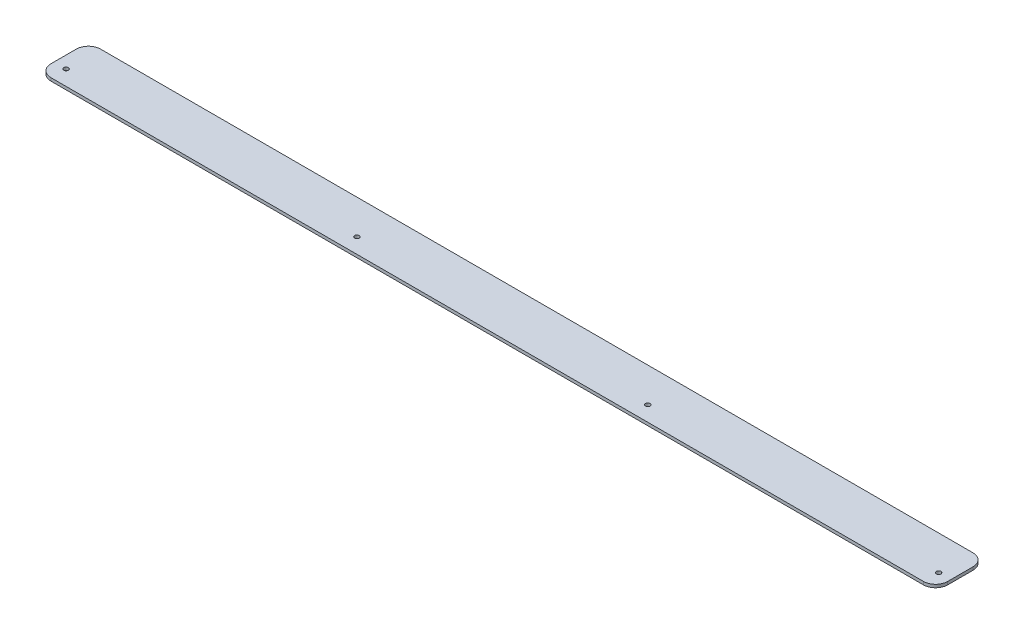
ISO-10303-21;
HEADER;
FILE_DESCRIPTION(('STEP AP214'),'2;1');
FILE_NAME('part.step','',(''),(''),'','','');
FILE_SCHEMA(('AUTOMOTIVE_DESIGN { 1 0 10303 214 1 1 1 1 }'));
ENDSEC;
DATA;
#1=APPLICATION_CONTEXT('core data for automotive mechanical design processes');
#2=APPLICATION_PROTOCOL_DEFINITION('international standard','automotive_design',2000,#1);
#3=PRODUCT_CONTEXT('',#1,'mechanical');
#4=PRODUCT('Part','Part','',(#3));
#5=PRODUCT_RELATED_PRODUCT_CATEGORY('part','',(#4));
#6=PRODUCT_DEFINITION_FORMATION('','',#4);
#7=PRODUCT_DEFINITION_CONTEXT('part definition',#1,'design');
#8=PRODUCT_DEFINITION('design','',#6,#7);
#9=PRODUCT_DEFINITION_SHAPE('','',#8);
#10=(LENGTH_UNIT() NAMED_UNIT(*) SI_UNIT(.MILLI.,.METRE.));
#11=(NAMED_UNIT(*) PLANE_ANGLE_UNIT() SI_UNIT($,.RADIAN.));
#12=(NAMED_UNIT(*) SI_UNIT($,.STERADIAN.) SOLID_ANGLE_UNIT());
#13=UNCERTAINTY_MEASURE_WITH_UNIT(LENGTH_MEASURE(1.E-05),#10,'distance_accuracy_value','');
#14=(GEOMETRIC_REPRESENTATION_CONTEXT(3) GLOBAL_UNCERTAINTY_ASSIGNED_CONTEXT((#13)) GLOBAL_UNIT_ASSIGNED_CONTEXT((#10,
#11,#12)) REPRESENTATION_CONTEXT('',''));
#15=CARTESIAN_POINT('',(0.,0.,0.));
#16=DIRECTION('',(0.,0.,1.));
#17=DIRECTION('',(1.,0.,0.));
#18=AXIS2_PLACEMENT_3D('',#15,#16,#17);
#19=CARTESIAN_POINT('',(-469.9,-3.17500000000002,-12.2434175063606));
#20=DIRECTION('',(-1.,0.,0.));
#21=DIRECTION('',(0.,1.,0.));
#22=AXIS2_PLACEMENT_3D('',#19,#20,#21);
#23=PLANE('',#22);
#24=DIRECTION('',(0.,0.,-1.));
#25=VECTOR('',#24,1.);
#26=CARTESIAN_POINT('',(-469.9,0.,-12.2434175063606));
#27=LINE('',#26,#25);
#28=CARTESIAN_POINT('',(-469.9,0.,-24.9434175063606));
#29=VERTEX_POINT('',#28);
#30=CARTESIAN_POINT('',(-469.9,0.,1.58750000000005));
#31=VERTEX_POINT('',#30);
#32=EDGE_CURVE('E196',#29,#31,#27,.F.);
#33=ORIENTED_EDGE('',*,*,#32,.F.);
#34=DIRECTION('',(0.,1.,0.));
#35=VECTOR('',#34,1.);
#36=CARTESIAN_POINT('',(-469.9,-3.17500000000007,-24.9434175063606));
#37=LINE('',#36,#35);
#38=CARTESIAN_POINT('',(-469.9,-3.17500000000007,-24.9434175063606));
#39=VERTEX_POINT('',#38);
#40=EDGE_CURVE('E81',#29,#39,#37,.F.);
#41=ORIENTED_EDGE('',*,*,#40,.T.);
#42=DIRECTION('',(0.,0.,1.));
#43=VECTOR('',#42,1.);
#44=CARTESIAN_POINT('',(-469.9,-3.17500000000002,-12.2434175063606));
#45=LINE('',#44,#43);
#46=CARTESIAN_POINT('',(-469.9,-3.175,1.58750000000005));
#47=VERTEX_POINT('',#46);
#48=EDGE_CURVE('E188',#39,#47,#45,.T.);
#49=ORIENTED_EDGE('',*,*,#48,.T.);
#50=DIRECTION('',(0.,1.,0.));
#51=VECTOR('',#50,1.);
#52=CARTESIAN_POINT('',(-469.9,-3.175,1.58750000000005));
#53=LINE('',#52,#51);
#54=EDGE_CURVE('E134',#47,#31,#53,.T.);
#55=ORIENTED_EDGE('',*,*,#54,.T.);
#56=EDGE_LOOP('',(#33,#41,#49,#55));
#57=FACE_BOUND('',#56,.T.);
#58=ADVANCED_FACE('F58',(#57),#23,.T.);
#59=CARTESIAN_POINT('',(469.9,-3.17500000000011,-37.6434175063606));
#60=DIRECTION('',(1.,0.,0.));
#61=DIRECTION('',(0.,-1.,0.));
#62=AXIS2_PLACEMENT_3D('',#59,#60,#61);
#63=PLANE('',#62);
#64=DIRECTION('',(0.,0.,-1.));
#65=VECTOR('',#64,1.);
#66=CARTESIAN_POINT('',(469.9,-3.17500000000011,-37.6434175063606));
#67=LINE('',#66,#65);
#68=CARTESIAN_POINT('',(469.9,-3.175,1.58749999999994));
#69=VERTEX_POINT('',#68);
#70=CARTESIAN_POINT('',(469.9,-3.17500000000007,-24.9434175063606));
#71=VERTEX_POINT('',#70);
#72=EDGE_CURVE('E194',#69,#71,#67,.T.);
#73=ORIENTED_EDGE('',*,*,#72,.T.);
#74=DIRECTION('',(0.,1.,0.));
#75=VECTOR('',#74,1.);
#76=CARTESIAN_POINT('',(469.9,-3.17500000000007,-24.9434175063606));
#77=LINE('',#76,#75);
#78=CARTESIAN_POINT('',(469.9,0.,-24.9434175063606));
#79=VERTEX_POINT('',#78);
#80=EDGE_CURVE('E13',#71,#79,#77,.T.);
#81=ORIENTED_EDGE('',*,*,#80,.T.);
#82=DIRECTION('',(0.,0.,1.));
#83=VECTOR('',#82,1.);
#84=CARTESIAN_POINT('',(469.9,0.,-12.2434175063606));
#85=LINE('',#84,#83);
#86=CARTESIAN_POINT('',(469.9,0.,1.58749999999994));
#87=VERTEX_POINT('',#86);
#88=EDGE_CURVE('E125',#87,#79,#85,.F.);
#89=ORIENTED_EDGE('',*,*,#88,.F.);
#90=DIRECTION('',(0.,1.,0.));
#91=VECTOR('',#90,1.);
#92=CARTESIAN_POINT('',(469.9,-3.175,1.58749999999994));
#93=LINE('',#92,#91);
#94=EDGE_CURVE('E129',#87,#69,#93,.F.);
#95=ORIENTED_EDGE('',*,*,#94,.T.);
#96=EDGE_LOOP('',(#73,#81,#89,#95));
#97=FACE_BOUND('',#96,.T.);
#98=ADVANCED_FACE('F127',(#97),#63,.T.);
#99=CARTESIAN_POINT('',(0.,-3.17500000000002,-12.2434175063606));
#100=DIRECTION('',(0.,-1.,0.));
#101=DIRECTION('',(-1.,0.,0.));
#102=AXIS2_PLACEMENT_3D('',#99,#100,#101);
#103=PLANE('',#102);
#104=ORIENTED_EDGE('',*,*,#48,.F.);
#105=CARTESIAN_POINT('',(-457.2,-3.17500000000007,-24.9434175063606));
#106=DIRECTION('',(0.,-1.,0.));
#107=DIRECTION('',(-1.,0.,0.));
#108=AXIS2_PLACEMENT_3D('',#105,#106,#107);
#109=CIRCLE('',#108,12.7);
#110=CARTESIAN_POINT('',(-457.2,-3.17500000000011,-37.6434175063606));
#111=VERTEX_POINT('',#110);
#112=EDGE_CURVE('E66',#39,#111,#109,.T.);
#113=ORIENTED_EDGE('',*,*,#112,.T.);
#114=DIRECTION('',(-1.,0.,0.));
#115=VECTOR('',#114,1.);
#116=CARTESIAN_POINT('',(-469.9,-3.17500000000011,-37.6434175063606));
#117=LINE('',#116,#115);
#118=CARTESIAN_POINT('',(457.2,-3.17500000000011,-37.6434175063606));
#119=VERTEX_POINT('',#118);
#120=EDGE_CURVE('E191',#119,#111,#117,.T.);
#121=ORIENTED_EDGE('',*,*,#120,.F.);
#122=CARTESIAN_POINT('',(457.2,-3.17500000000007,-24.9434175063606));
#123=DIRECTION('',(0.,-1.,0.));
#124=DIRECTION('',(-1.,0.,0.));
#125=AXIS2_PLACEMENT_3D('',#122,#123,#124);
#126=CIRCLE('',#125,12.7);
#127=EDGE_CURVE('E73',#119,#71,#126,.T.);
#128=ORIENTED_EDGE('',*,*,#127,.T.);
#129=ORIENTED_EDGE('',*,*,#72,.F.);
#130=CARTESIAN_POINT('',(457.2,-3.175,1.58749999999994));
#131=DIRECTION('',(0.,1.,0.));
#132=DIRECTION('',(0.,0.,1.));
#133=AXIS2_PLACEMENT_3D('',#130,#131,#132);
#134=CIRCLE('',#133,12.7);
#135=CARTESIAN_POINT('',(457.2,-3.175,14.2874999999999));
#136=VERTEX_POINT('',#135);
#137=EDGE_CURVE('E147',#69,#136,#134,.F.);
#138=ORIENTED_EDGE('',*,*,#137,.T.);
#139=DIRECTION('',(1.,0.,0.));
#140=VECTOR('',#139,1.);
#141=CARTESIAN_POINT('',(469.9,-3.175,14.2874999999999));
#142=LINE('',#141,#140);
#143=CARTESIAN_POINT('',(-457.2,-3.175,14.2875000000001));
#144=VERTEX_POINT('',#143);
#145=EDGE_CURVE('E177',#144,#136,#142,.T.);
#146=ORIENTED_EDGE('',*,*,#145,.F.);
#147=CARTESIAN_POINT('',(-457.2,-3.175,1.58750000000005));
#148=DIRECTION('',(0.,1.,0.));
#149=DIRECTION('',(0.,0.,1.));
#150=AXIS2_PLACEMENT_3D('',#147,#148,#149);
#151=CIRCLE('',#150,12.7);
#152=EDGE_CURVE('E160',#144,#47,#151,.F.);
#153=ORIENTED_EDGE('',*,*,#152,.T.);
#154=EDGE_LOOP('',(#104,#113,#121,#128,#129,#138,#146,#153));
#155=FACE_BOUND('',#154,.T.);
#156=CARTESIAN_POINT('',(-152.4,-3.17500000000003,-1.58750000000004));
#157=DIRECTION('',(0.,1.,0.));
#158=DIRECTION('',(0.,0.,1.));
#159=AXIS2_PLACEMENT_3D('',#156,#157,#158);
#160=CIRCLE('',#159,2.42569999999998);
#161=CARTESIAN_POINT('',(-152.4,-3.17500000000003,0.838199999999932));
#162=VERTEX_POINT('',#161);
#163=EDGE_CURVE('E166',#162,#162,#160,.T.);
#164=ORIENTED_EDGE('',*,*,#163,.T.);
#165=EDGE_LOOP('',(#164));
#166=FACE_BOUND('',#165,.T.);
#167=CARTESIAN_POINT('',(-457.2,-3.17500000000003,-1.58750000000001));
#168=DIRECTION('',(0.,1.,0.));
#169=DIRECTION('',(0.,0.,1.));
#170=AXIS2_PLACEMENT_3D('',#167,#168,#169);
#171=CIRCLE('',#170,2.42569999999998);
#172=CARTESIAN_POINT('',(-457.2,-3.17500000000003,0.83819999999997));
#173=VERTEX_POINT('',#172);
#174=EDGE_CURVE('E163',#173,#173,#171,.T.);
#175=ORIENTED_EDGE('',*,*,#174,.T.);
#176=EDGE_LOOP('',(#175));
#177=FACE_BOUND('',#176,.T.);
#178=CARTESIAN_POINT('',(152.4,-3.17500000000003,-1.58750000000008));
#179=DIRECTION('',(0.,1.,0.));
#180=DIRECTION('',(0.,0.,1.));
#181=AXIS2_PLACEMENT_3D('',#178,#179,#180);
#182=CIRCLE('',#181,2.42569999999998);
#183=CARTESIAN_POINT('',(152.4,-3.17500000000003,0.838199999999895));
#184=VERTEX_POINT('',#183);
#185=EDGE_CURVE('E153',#184,#184,#182,.T.);
#186=ORIENTED_EDGE('',*,*,#185,.T.);
#187=EDGE_LOOP('',(#186));
#188=FACE_BOUND('',#187,.T.);
#189=CARTESIAN_POINT('',(457.2,-3.17500000000003,-1.58750000000012));
#190=DIRECTION('',(0.,1.,0.));
#191=DIRECTION('',(0.,0.,1.));
#192=AXIS2_PLACEMENT_3D('',#189,#190,#191);
#193=CIRCLE('',#192,2.42569999999998);
#194=CARTESIAN_POINT('',(457.2,-3.17500000000003,0.838199999999859));
#195=VERTEX_POINT('',#194);
#196=EDGE_CURVE('E149',#195,#195,#193,.T.);
#197=ORIENTED_EDGE('',*,*,#196,.T.);
#198=EDGE_LOOP('',(#197));
#199=FACE_BOUND('',#198,.T.);
#200=ADVANCED_FACE('F209',(#155,#166,#177,#188,#199),#103,.T.);
#201=CARTESIAN_POINT('',(0.,0.,0.));
#202=DIRECTION('',(0.,1.,0.));
#203=DIRECTION('',(0.,0.,1.));
#204=AXIS2_PLACEMENT_3D('',#201,#202,#203);
#205=PLANE('',#204);
#206=DIRECTION('',(1.,0.,0.));
#207=VECTOR('',#206,1.);
#208=CARTESIAN_POINT('',(0.,-1.07552855510562E-13,-37.6434175063606));
#209=LINE('',#208,#207);
#210=CARTESIAN_POINT('',(457.2,-1.07552855510562E-13,-37.6434175063606));
#211=VERTEX_POINT('',#210);
#212=CARTESIAN_POINT('',(-457.2,-1.07552855510562E-13,-37.6434175063606));
#213=VERTEX_POINT('',#212);
#214=EDGE_CURVE('E133',#211,#213,#209,.F.);
#215=ORIENTED_EDGE('',*,*,#214,.T.);
#216=CARTESIAN_POINT('',(-457.2,0.,-24.9434175063606));
#217=DIRECTION('',(0.,-1.,0.));
#218=DIRECTION('',(-1.,0.,0.));
#219=AXIS2_PLACEMENT_3D('',#216,#217,#218);
#220=CIRCLE('',#219,12.7);
#221=EDGE_CURVE('E205',#213,#29,#220,.F.);
#222=ORIENTED_EDGE('',*,*,#221,.T.);
#223=ORIENTED_EDGE('',*,*,#32,.T.);
#224=CARTESIAN_POINT('',(-457.2,0.,1.58750000000005));
#225=DIRECTION('',(0.,1.,0.));
#226=DIRECTION('',(0.,0.,1.));
#227=AXIS2_PLACEMENT_3D('',#224,#225,#226);
#228=CIRCLE('',#227,12.7);
#229=CARTESIAN_POINT('',(-457.2,0.,14.2875000000001));
#230=VERTEX_POINT('',#229);
#231=EDGE_CURVE('E148',#31,#230,#228,.T.);
#232=ORIENTED_EDGE('',*,*,#231,.T.);
#233=DIRECTION('',(1.,0.,0.));
#234=VECTOR('',#233,1.);
#235=CARTESIAN_POINT('',(469.9,0.,14.2874999999999));
#236=LINE('',#235,#234);
#237=CARTESIAN_POINT('',(457.2,0.,14.2874999999999));
#238=VERTEX_POINT('',#237);
#239=EDGE_CURVE('E141',#230,#238,#236,.T.);
#240=ORIENTED_EDGE('',*,*,#239,.T.);
#241=CARTESIAN_POINT('',(457.2,0.,1.58749999999994));
#242=DIRECTION('',(0.,1.,0.));
#243=DIRECTION('',(0.,0.,1.));
#244=AXIS2_PLACEMENT_3D('',#241,#242,#243);
#245=CIRCLE('',#244,12.7);
#246=EDGE_CURVE('E137',#238,#87,#245,.T.);
#247=ORIENTED_EDGE('',*,*,#246,.T.);
#248=ORIENTED_EDGE('',*,*,#88,.T.);
#249=CARTESIAN_POINT('',(457.2,0.,-24.9434175063606));
#250=DIRECTION('',(0.,-1.,0.));
#251=DIRECTION('',(-1.,0.,0.));
#252=AXIS2_PLACEMENT_3D('',#249,#250,#251);
#253=CIRCLE('',#252,12.7);
#254=EDGE_CURVE('E203',#79,#211,#253,.F.);
#255=ORIENTED_EDGE('',*,*,#254,.T.);
#256=EDGE_LOOP('',(#215,#222,#223,#232,#240,#247,#248,#255));
#257=FACE_BOUND('',#256,.T.);
#258=CARTESIAN_POINT('',(-152.4,0.,-1.58750000000004));
#259=DIRECTION('',(0.,1.,0.));
#260=DIRECTION('',(0.,0.,1.));
#261=AXIS2_PLACEMENT_3D('',#258,#259,#260);
#262=CIRCLE('',#261,2.42569999999998);
#263=CARTESIAN_POINT('',(-152.4,0.,0.838199999999932));
#264=VERTEX_POINT('',#263);
#265=EDGE_CURVE('E169',#264,#264,#262,.T.);
#266=ORIENTED_EDGE('',*,*,#265,.F.);
#267=EDGE_LOOP('',(#266));
#268=FACE_BOUND('',#267,.T.);
#269=CARTESIAN_POINT('',(-457.2,0.,-1.58750000000001));
#270=DIRECTION('',(0.,1.,0.));
#271=DIRECTION('',(0.,0.,1.));
#272=AXIS2_PLACEMENT_3D('',#269,#270,#271);
#273=CIRCLE('',#272,2.42569999999998);
#274=CARTESIAN_POINT('',(-457.2,0.,0.83819999999997));
#275=VERTEX_POINT('',#274);
#276=EDGE_CURVE('E172',#275,#275,#273,.T.);
#277=ORIENTED_EDGE('',*,*,#276,.F.);
#278=EDGE_LOOP('',(#277));
#279=FACE_BOUND('',#278,.T.);
#280=CARTESIAN_POINT('',(152.4,0.,-1.58750000000008));
#281=DIRECTION('',(0.,1.,0.));
#282=DIRECTION('',(0.,0.,1.));
#283=AXIS2_PLACEMENT_3D('',#280,#281,#282);
#284=CIRCLE('',#283,2.42569999999998);
#285=CARTESIAN_POINT('',(152.4,0.,0.838199999999895));
#286=VERTEX_POINT('',#285);
#287=EDGE_CURVE('E182',#286,#286,#284,.T.);
#288=ORIENTED_EDGE('',*,*,#287,.F.);
#289=EDGE_LOOP('',(#288));
#290=FACE_BOUND('',#289,.T.);
#291=CARTESIAN_POINT('',(457.2,0.,-1.58750000000012));
#292=DIRECTION('',(0.,1.,0.));
#293=DIRECTION('',(0.,0.,1.));
#294=AXIS2_PLACEMENT_3D('',#291,#292,#293);
#295=CIRCLE('',#294,2.42569999999998);
#296=CARTESIAN_POINT('',(457.2,0.,0.838199999999859));
#297=VERTEX_POINT('',#296);
#298=EDGE_CURVE('E185',#297,#297,#295,.T.);
#299=ORIENTED_EDGE('',*,*,#298,.F.);
#300=EDGE_LOOP('',(#299));
#301=FACE_BOUND('',#300,.T.);
#302=ADVANCED_FACE('F60',(#257,#268,#279,#290,#301),#205,.T.);
#303=CARTESIAN_POINT('',(-469.9,-3.17500000000011,-37.6434175063606));
#304=DIRECTION('',(0.,0.,-1.));
#305=DIRECTION('',(0.,1.,0.));
#306=AXIS2_PLACEMENT_3D('',#303,#304,#305);
#307=PLANE('',#306);
#308=ORIENTED_EDGE('',*,*,#120,.T.);
#309=DIRECTION('',(0.,1.,0.));
#310=VECTOR('',#309,1.);
#311=CARTESIAN_POINT('',(-457.2,-3.17500000000011,-37.6434175063606));
#312=LINE('',#311,#310);
#313=EDGE_CURVE('E200',#111,#213,#312,.T.);
#314=ORIENTED_EDGE('',*,*,#313,.T.);
#315=ORIENTED_EDGE('',*,*,#214,.F.);
#316=DIRECTION('',(0.,1.,0.));
#317=VECTOR('',#316,1.);
#318=CARTESIAN_POINT('',(457.2,-3.17500000000011,-37.6434175063606));
#319=LINE('',#318,#317);
#320=EDGE_CURVE('E190',#211,#119,#319,.F.);
#321=ORIENTED_EDGE('',*,*,#320,.T.);
#322=EDGE_LOOP('',(#308,#314,#315,#321));
#323=FACE_BOUND('',#322,.T.);
#324=ADVANCED_FACE('F214',(#323),#307,.T.);
#325=CARTESIAN_POINT('',(-457.2,-3.17500000000007,-24.9434175063606));
#326=DIRECTION('',(0.,1.,0.));
#327=DIRECTION('',(1.,0.,0.));
#328=AXIS2_PLACEMENT_3D('',#325,#326,#327);
#329=CYLINDRICAL_SURFACE('',#328,12.7);
#330=ORIENTED_EDGE('',*,*,#112,.F.);
#331=ORIENTED_EDGE('',*,*,#40,.F.);
#332=ORIENTED_EDGE('',*,*,#221,.F.);
#333=ORIENTED_EDGE('',*,*,#313,.F.);
#334=EDGE_LOOP('',(#330,#331,#332,#333));
#335=FACE_BOUND('',#334,.T.);
#336=ADVANCED_FACE('F217',(#335),#329,.T.);
#337=CARTESIAN_POINT('',(457.2,-3.17500000000007,-24.9434175063606));
#338=DIRECTION('',(0.,1.,0.));
#339=DIRECTION('',(1.,0.,0.));
#340=AXIS2_PLACEMENT_3D('',#337,#338,#339);
#341=CYLINDRICAL_SURFACE('',#340,12.7);
#342=ORIENTED_EDGE('',*,*,#127,.F.);
#343=ORIENTED_EDGE('',*,*,#320,.F.);
#344=ORIENTED_EDGE('',*,*,#254,.F.);
#345=ORIENTED_EDGE('',*,*,#80,.F.);
#346=EDGE_LOOP('',(#342,#343,#344,#345));
#347=FACE_BOUND('',#346,.T.);
#348=ADVANCED_FACE('F230',(#347),#341,.T.);
#349=CARTESIAN_POINT('',(457.2,0.,-1.58750000000012));
#350=DIRECTION('',(0.,1.,0.));
#351=DIRECTION('',(0.,0.,1.));
#352=AXIS2_PLACEMENT_3D('',#349,#350,#351);
#353=CYLINDRICAL_SURFACE('',#352,2.42569999999998);
#354=ORIENTED_EDGE('',*,*,#196,.F.);
#355=EDGE_LOOP('',(#354));
#356=FACE_BOUND('',#355,.T.);
#357=ORIENTED_EDGE('',*,*,#298,.T.);
#358=EDGE_LOOP('',(#357));
#359=FACE_BOUND('',#358,.T.);
#360=ADVANCED_FACE('F232',(#356,#359),#353,.F.);
#361=CARTESIAN_POINT('',(152.4,0.,-1.58750000000008));
#362=DIRECTION('',(0.,1.,0.));
#363=DIRECTION('',(0.,0.,1.));
#364=AXIS2_PLACEMENT_3D('',#361,#362,#363);
#365=CYLINDRICAL_SURFACE('',#364,2.42569999999998);
#366=ORIENTED_EDGE('',*,*,#185,.F.);
#367=EDGE_LOOP('',(#366));
#368=FACE_BOUND('',#367,.T.);
#369=ORIENTED_EDGE('',*,*,#287,.T.);
#370=EDGE_LOOP('',(#369));
#371=FACE_BOUND('',#370,.T.);
#372=ADVANCED_FACE('F237',(#368,#371),#365,.F.);
#373=CARTESIAN_POINT('',(457.2,-3.175,1.58749999999994));
#374=DIRECTION('',(0.,1.,0.));
#375=DIRECTION('',(0.,0.,1.));
#376=AXIS2_PLACEMENT_3D('',#373,#374,#375);
#377=CYLINDRICAL_SURFACE('',#376,12.7);
#378=ORIENTED_EDGE('',*,*,#137,.F.);
#379=ORIENTED_EDGE('',*,*,#94,.F.);
#380=ORIENTED_EDGE('',*,*,#246,.F.);
#381=DIRECTION('',(0.,1.,0.));
#382=VECTOR('',#381,1.);
#383=CARTESIAN_POINT('',(457.2,-3.175,14.2874999999999));
#384=LINE('',#383,#382);
#385=EDGE_CURVE('E175',#136,#238,#384,.T.);
#386=ORIENTED_EDGE('',*,*,#385,.F.);
#387=EDGE_LOOP('',(#378,#379,#380,#386));
#388=FACE_BOUND('',#387,.T.);
#389=ADVANCED_FACE('F146',(#388),#377,.T.);
#390=CARTESIAN_POINT('',(-457.2,-3.175,1.58750000000005));
#391=DIRECTION('',(0.,1.,0.));
#392=DIRECTION('',(0.,0.,1.));
#393=AXIS2_PLACEMENT_3D('',#390,#391,#392);
#394=CYLINDRICAL_SURFACE('',#393,12.7);
#395=ORIENTED_EDGE('',*,*,#152,.F.);
#396=DIRECTION('',(0.,1.,0.));
#397=VECTOR('',#396,1.);
#398=CARTESIAN_POINT('',(-457.2,-3.175,14.2875000000001));
#399=LINE('',#398,#397);
#400=EDGE_CURVE('E180',#230,#144,#399,.F.);
#401=ORIENTED_EDGE('',*,*,#400,.F.);
#402=ORIENTED_EDGE('',*,*,#231,.F.);
#403=ORIENTED_EDGE('',*,*,#54,.F.);
#404=EDGE_LOOP('',(#395,#401,#402,#403));
#405=FACE_BOUND('',#404,.T.);
#406=ADVANCED_FACE('F224',(#405),#394,.T.);
#407=CARTESIAN_POINT('',(469.9,-3.175,14.2874999999999));
#408=DIRECTION('',(0.,0.,1.));
#409=DIRECTION('',(1.,0.,0.));
#410=AXIS2_PLACEMENT_3D('',#407,#408,#409);
#411=PLANE('',#410);
#412=ORIENTED_EDGE('',*,*,#239,.F.);
#413=ORIENTED_EDGE('',*,*,#400,.T.);
#414=ORIENTED_EDGE('',*,*,#145,.T.);
#415=ORIENTED_EDGE('',*,*,#385,.T.);
#416=EDGE_LOOP('',(#412,#413,#414,#415));
#417=FACE_BOUND('',#416,.T.);
#418=ADVANCED_FACE('F227',(#417),#411,.T.);
#419=CARTESIAN_POINT('',(-457.2,0.,-1.58750000000001));
#420=DIRECTION('',(0.,1.,0.));
#421=DIRECTION('',(0.,0.,1.));
#422=AXIS2_PLACEMENT_3D('',#419,#420,#421);
#423=CYLINDRICAL_SURFACE('',#422,2.42569999999998);
#424=ORIENTED_EDGE('',*,*,#174,.F.);
#425=EDGE_LOOP('',(#424));
#426=FACE_BOUND('',#425,.T.);
#427=ORIENTED_EDGE('',*,*,#276,.T.);
#428=EDGE_LOOP('',(#427));
#429=FACE_BOUND('',#428,.T.);
#430=ADVANCED_FACE('F348',(#426,#429),#423,.F.);
#431=CARTESIAN_POINT('',(-152.4,0.,-1.58750000000004));
#432=DIRECTION('',(0.,1.,0.));
#433=DIRECTION('',(0.,0.,1.));
#434=AXIS2_PLACEMENT_3D('',#431,#432,#433);
#435=CYLINDRICAL_SURFACE('',#434,2.42569999999998);
#436=ORIENTED_EDGE('',*,*,#163,.F.);
#437=EDGE_LOOP('',(#436));
#438=FACE_BOUND('',#437,.T.);
#439=ORIENTED_EDGE('',*,*,#265,.T.);
#440=EDGE_LOOP('',(#439));
#441=FACE_BOUND('',#440,.T.);
#442=ADVANCED_FACE('F357',(#438,#441),#435,.F.);
#443=CLOSED_SHELL('',(#58,#98,#200,#302,#324,#336,#348,#360,#372,#389,#406,#418,#430,#442));
#444=MANIFOLD_SOLID_BREP('B2',#443);
#445=ADVANCED_BREP_SHAPE_REPRESENTATION('',(#18,#444),#14);
#446=SHAPE_DEFINITION_REPRESENTATION(#9,#445);
ENDSEC;
END-ISO-10303-21;
